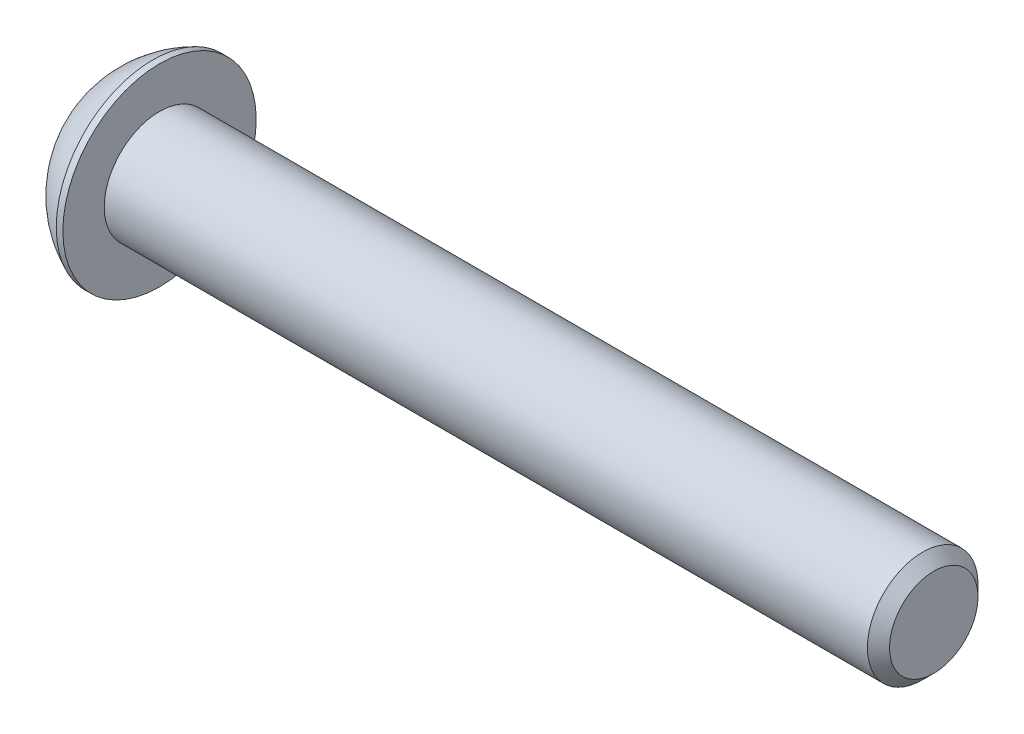
ISO-10303-21;
HEADER;
FILE_DESCRIPTION(('STEP AP214'),'2;1');
FILE_NAME('part.step','',(''),(''),'','','');
FILE_SCHEMA(('AUTOMOTIVE_DESIGN { 1 0 10303 214 1 1 1 1 }'));
ENDSEC;
DATA;
#1=APPLICATION_CONTEXT('core data for automotive mechanical design processes');
#2=APPLICATION_PROTOCOL_DEFINITION('international standard','automotive_design',2000,#1);
#3=PRODUCT_CONTEXT('',#1,'mechanical');
#4=PRODUCT('Part','Part','',(#3));
#5=PRODUCT_RELATED_PRODUCT_CATEGORY('part','',(#4));
#6=PRODUCT_DEFINITION_FORMATION('','',#4);
#7=PRODUCT_DEFINITION_CONTEXT('part definition',#1,'design');
#8=PRODUCT_DEFINITION('design','',#6,#7);
#9=PRODUCT_DEFINITION_SHAPE('','',#8);
#10=(LENGTH_UNIT() NAMED_UNIT(*) SI_UNIT(.MILLI.,.METRE.));
#11=(NAMED_UNIT(*) PLANE_ANGLE_UNIT() SI_UNIT($,.RADIAN.));
#12=(NAMED_UNIT(*) SI_UNIT($,.STERADIAN.) SOLID_ANGLE_UNIT());
#13=UNCERTAINTY_MEASURE_WITH_UNIT(LENGTH_MEASURE(1.E-05),#10,'distance_accuracy_value','');
#14=(GEOMETRIC_REPRESENTATION_CONTEXT(3) GLOBAL_UNCERTAINTY_ASSIGNED_CONTEXT((#13)) GLOBAL_UNIT_ASSIGNED_CONTEXT((#10,
#11,#12)) REPRESENTATION_CONTEXT('',''));
#15=CARTESIAN_POINT('',(0.,0.,0.));
#16=DIRECTION('',(0.,0.,1.));
#17=DIRECTION('',(1.,0.,0.));
#18=AXIS2_PLACEMENT_3D('',#15,#16,#17);
#19=CARTESIAN_POINT('',(1.32080000000034,0.,0.));
#20=DIRECTION('',(-1.,0.,0.));
#21=DIRECTION('',(0.,0.,1.));
#22=AXIS2_PLACEMENT_3D('',#19,#20,#21);
#23=CONICAL_SURFACE('',#22,1.1937999999998,1.04719755119608);
#24=CARTESIAN_POINT('',(2.01004075135902,0.,-4.44089209850063E-13));
#25=VERTEX_POINT('',#24);
#26=VERTEX_LOOP('',#25);
#27=FACE_BOUND('',#26,.T.);
#28=CARTESIAN_POINT('',(1.32080000000009,0.,0.));
#29=DIRECTION('',(-1.,0.,0.));
#30=DIRECTION('',(0.,0.,1.));
#31=AXIS2_PLACEMENT_3D('',#28,#29,#30);
#32=CIRCLE('',#31,1.19380000000024);
#33=CARTESIAN_POINT('',(1.32080000000009,0.,1.19380000000024));
#34=VERTEX_POINT('',#33);
#35=EDGE_CURVE('E20',#34,#34,#32,.T.);
#36=ORIENTED_EDGE('',*,*,#35,.T.);
#37=EDGE_LOOP('',(#36));
#38=FACE_BOUND('',#37,.T.);
#39=ADVANCED_FACE('F17',(#27,#38),#23,.F.);
#40=CARTESIAN_POINT('',(1.3208,-2.29135888084633,0.));
#41=DIRECTION('',(1.,0.,0.));
#42=DIRECTION('',(0.,0.,-1.));
#43=AXIS2_PLACEMENT_3D('',#40,#41,#42);
#44=PLANE('',#43);
#45=DIRECTION('',(0.,1.,0.));
#46=VECTOR('',#45,1.);
#47=CARTESIAN_POINT('',(1.3208,-1.14567944042316,1.984375));
#48=LINE('',#47,#46);
#49=CARTESIAN_POINT('',(1.3208,1.14567944042316,1.984375));
#50=VERTEX_POINT('',#49);
#51=CARTESIAN_POINT('',(1.3208,-1.14567944042316,1.984375));
#52=VERTEX_POINT('',#51);
#53=EDGE_CURVE('E69',#50,#52,#48,.F.);
#54=ORIENTED_EDGE('',*,*,#53,.F.);
#55=DIRECTION('',(0.,0.5,-0.866025403784439));
#56=VECTOR('',#55,1.);
#57=CARTESIAN_POINT('',(1.3208,1.14567944042316,1.984375));
#58=LINE('',#57,#56);
#59=CARTESIAN_POINT('',(1.3208,2.29135888084633,0.));
#60=VERTEX_POINT('',#59);
#61=EDGE_CURVE('E292',#60,#50,#58,.F.);
#62=ORIENTED_EDGE('',*,*,#61,.F.);
#63=DIRECTION('',(0.,-0.5,-0.866025403784439));
#64=VECTOR('',#63,1.);
#65=CARTESIAN_POINT('',(1.3208,2.29135888084633,0.));
#66=LINE('',#65,#64);
#67=CARTESIAN_POINT('',(1.3208,1.14567944042316,-1.984375));
#68=VERTEX_POINT('',#67);
#69=EDGE_CURVE('E296',#68,#60,#66,.F.);
#70=ORIENTED_EDGE('',*,*,#69,.F.);
#71=DIRECTION('',(0.,1.,0.));
#72=VECTOR('',#71,1.);
#73=CARTESIAN_POINT('',(1.3208,1.14567944042316,-1.984375));
#74=LINE('',#73,#72);
#75=CARTESIAN_POINT('',(1.3208,-1.14567944042316,-1.984375));
#76=VERTEX_POINT('',#75);
#77=EDGE_CURVE('E301',#76,#68,#74,.T.);
#78=ORIENTED_EDGE('',*,*,#77,.F.);
#79=DIRECTION('',(0.,-0.500000000000001,0.866025403784438));
#80=VECTOR('',#79,1.);
#81=CARTESIAN_POINT('',(1.3208,-1.14567944042316,-1.984375));
#82=LINE('',#81,#80);
#83=CARTESIAN_POINT('',(1.3208,-2.29135888084633,0.));
#84=VERTEX_POINT('',#83);
#85=EDGE_CURVE('E306',#84,#76,#82,.F.);
#86=ORIENTED_EDGE('',*,*,#85,.F.);
#87=DIRECTION('',(0.,0.500000000000001,0.866025403784438));
#88=VECTOR('',#87,1.);
#89=CARTESIAN_POINT('',(1.3208,-2.29135888084633,0.));
#90=LINE('',#89,#88);
#91=EDGE_CURVE('E82',#52,#84,#90,.F.);
#92=ORIENTED_EDGE('',*,*,#91,.F.);
#93=EDGE_LOOP('',(#54,#62,#70,#78,#86,#92));
#94=FACE_BOUND('',#93,.T.);
#95=ORIENTED_EDGE('',*,*,#35,.F.);
#96=EDGE_LOOP('',(#95));
#97=FACE_BOUND('',#96,.T.);
#98=ADVANCED_FACE('F75',(#94,#97),#44,.F.);
#99=CARTESIAN_POINT('',(1.3208,-1.14567944042316,1.984375));
#100=DIRECTION('',(0.,0.,-1.));
#101=DIRECTION('',(0.,1.,0.));
#102=AXIS2_PLACEMENT_3D('',#99,#100,#101);
#103=PLANE('',#102);
#104=ORIENTED_EDGE('',*,*,#53,.T.);
#105=DIRECTION('',(1.,0.,0.));
#106=VECTOR('',#105,1.);
#107=CARTESIAN_POINT('',(1.3208,-1.14567944042316,1.984375));
#108=LINE('',#107,#106);
#109=CARTESIAN_POINT('',(0.,-1.14567944042316,1.984375));
#110=VERTEX_POINT('',#109);
#111=EDGE_CURVE('E79',#110,#52,#108,.T.);
#112=ORIENTED_EDGE('',*,*,#111,.F.);
#113=DIRECTION('',(0.,1.,0.));
#114=VECTOR('',#113,1.);
#115=CARTESIAN_POINT('',(0.,0.,1.984375));
#116=LINE('',#115,#114);
#117=CARTESIAN_POINT('',(0.,1.14567944042316,1.984375));
#118=VERTEX_POINT('',#117);
#119=EDGE_CURVE('E286',#118,#110,#116,.F.);
#120=ORIENTED_EDGE('',*,*,#119,.F.);
#121=DIRECTION('',(1.,0.,0.));
#122=VECTOR('',#121,1.);
#123=CARTESIAN_POINT('',(1.3208,1.14567944042316,1.984375));
#124=LINE('',#123,#122);
#125=EDGE_CURVE('E289',#50,#118,#124,.F.);
#126=ORIENTED_EDGE('',*,*,#125,.F.);
#127=EDGE_LOOP('',(#104,#112,#120,#126));
#128=FACE_BOUND('',#127,.T.);
#129=ADVANCED_FACE('F128',(#128),#103,.T.);
#130=CARTESIAN_POINT('',(1.3208,-2.29135888084633,0.));
#131=DIRECTION('',(0.,0.866025403784438,-0.500000000000001));
#132=DIRECTION('',(0.,0.500000000000001,0.866025403784438));
#133=AXIS2_PLACEMENT_3D('',#130,#131,#132);
#134=PLANE('',#133);
#135=ORIENTED_EDGE('',*,*,#91,.T.);
#136=DIRECTION('',(1.,0.,0.));
#137=VECTOR('',#136,1.);
#138=CARTESIAN_POINT('',(1.3208,-2.29135888084633,0.));
#139=LINE('',#138,#137);
#140=CARTESIAN_POINT('',(0.,-2.29135888084633,0.));
#141=VERTEX_POINT('',#140);
#142=EDGE_CURVE('E308',#141,#84,#139,.T.);
#143=ORIENTED_EDGE('',*,*,#142,.F.);
#144=DIRECTION('',(0.,-0.500000000000001,-0.866025403784438));
#145=VECTOR('',#144,1.);
#146=CARTESIAN_POINT('',(0.,-1.14567944042316,1.984375));
#147=LINE('',#146,#145);
#148=EDGE_CURVE('E283',#110,#141,#147,.T.);
#149=ORIENTED_EDGE('',*,*,#148,.F.);
#150=ORIENTED_EDGE('',*,*,#111,.T.);
#151=EDGE_LOOP('',(#135,#143,#149,#150));
#152=FACE_BOUND('',#151,.T.);
#153=ADVANCED_FACE('F124',(#152),#134,.T.);
#154=CARTESIAN_POINT('',(1.3208,-1.14567944042316,-1.984375));
#155=DIRECTION('',(0.,0.866025403784438,0.500000000000001));
#156=DIRECTION('',(0.,-0.500000000000001,0.866025403784438));
#157=AXIS2_PLACEMENT_3D('',#154,#155,#156);
#158=PLANE('',#157);
#159=ORIENTED_EDGE('',*,*,#85,.T.);
#160=DIRECTION('',(1.,0.,0.));
#161=VECTOR('',#160,1.);
#162=CARTESIAN_POINT('',(1.3208,-1.14567944042316,-1.984375));
#163=LINE('',#162,#161);
#164=CARTESIAN_POINT('',(0.,-1.14567944042316,-1.984375));
#165=VERTEX_POINT('',#164);
#166=EDGE_CURVE('E303',#165,#76,#163,.T.);
#167=ORIENTED_EDGE('',*,*,#166,.F.);
#168=DIRECTION('',(0.,0.500000000000001,-0.866025403784438));
#169=VECTOR('',#168,1.);
#170=CARTESIAN_POINT('',(0.,-2.29135888084633,0.));
#171=LINE('',#170,#169);
#172=EDGE_CURVE('E280',#141,#165,#171,.T.);
#173=ORIENTED_EDGE('',*,*,#172,.F.);
#174=ORIENTED_EDGE('',*,*,#142,.T.);
#175=EDGE_LOOP('',(#159,#167,#173,#174));
#176=FACE_BOUND('',#175,.T.);
#177=ADVANCED_FACE('F120',(#176),#158,.T.);
#178=CARTESIAN_POINT('',(1.3208,1.14567944042316,-1.984375));
#179=DIRECTION('',(0.,0.,1.));
#180=DIRECTION('',(1.,0.,0.));
#181=AXIS2_PLACEMENT_3D('',#178,#179,#180);
#182=PLANE('',#181);
#183=ORIENTED_EDGE('',*,*,#77,.T.);
#184=DIRECTION('',(1.,0.,0.));
#185=VECTOR('',#184,1.);
#186=CARTESIAN_POINT('',(1.3208,1.14567944042316,-1.984375));
#187=LINE('',#186,#185);
#188=CARTESIAN_POINT('',(0.,1.14567944042316,-1.984375));
#189=VERTEX_POINT('',#188);
#190=EDGE_CURVE('E298',#189,#68,#187,.T.);
#191=ORIENTED_EDGE('',*,*,#190,.F.);
#192=DIRECTION('',(0.,1.,0.));
#193=VECTOR('',#192,1.);
#194=CARTESIAN_POINT('',(0.,0.,-1.984375));
#195=LINE('',#194,#193);
#196=EDGE_CURVE('E277',#165,#189,#195,.T.);
#197=ORIENTED_EDGE('',*,*,#196,.F.);
#198=ORIENTED_EDGE('',*,*,#166,.T.);
#199=EDGE_LOOP('',(#183,#191,#197,#198));
#200=FACE_BOUND('',#199,.T.);
#201=ADVANCED_FACE('F117',(#200),#182,.T.);
#202=CARTESIAN_POINT('',(1.3208,2.29135888084633,0.));
#203=DIRECTION('',(0.,-0.866025403784439,0.5));
#204=DIRECTION('',(0.,-0.5,-0.866025403784439));
#205=AXIS2_PLACEMENT_3D('',#202,#203,#204);
#206=PLANE('',#205);
#207=ORIENTED_EDGE('',*,*,#69,.T.);
#208=DIRECTION('',(1.,0.,0.));
#209=VECTOR('',#208,1.);
#210=CARTESIAN_POINT('',(1.3208,2.29135888084633,0.));
#211=LINE('',#210,#209);
#212=CARTESIAN_POINT('',(0.,2.29135888084633,0.));
#213=VERTEX_POINT('',#212);
#214=EDGE_CURVE('E35',#213,#60,#211,.T.);
#215=ORIENTED_EDGE('',*,*,#214,.F.);
#216=DIRECTION('',(0.,0.5,0.866025403784439));
#217=VECTOR('',#216,1.);
#218=CARTESIAN_POINT('',(0.,1.14567944042316,-1.984375));
#219=LINE('',#218,#217);
#220=EDGE_CURVE('E274',#189,#213,#219,.T.);
#221=ORIENTED_EDGE('',*,*,#220,.F.);
#222=ORIENTED_EDGE('',*,*,#190,.T.);
#223=EDGE_LOOP('',(#207,#215,#221,#222));
#224=FACE_BOUND('',#223,.T.);
#225=ADVANCED_FACE('F113',(#224),#206,.T.);
#226=CARTESIAN_POINT('',(1.3208,1.14567944042316,1.984375));
#227=DIRECTION('',(0.,-0.866025403784439,-0.5));
#228=DIRECTION('',(0.,0.5,-0.866025403784439));
#229=AXIS2_PLACEMENT_3D('',#226,#227,#228);
#230=PLANE('',#229);
#231=ORIENTED_EDGE('',*,*,#61,.T.);
#232=ORIENTED_EDGE('',*,*,#125,.T.);
#233=DIRECTION('',(0.,-0.5,0.866025403784438));
#234=VECTOR('',#233,1.);
#235=CARTESIAN_POINT('',(0.,2.29135888084633,0.));
#236=LINE('',#235,#234);
#237=EDGE_CURVE('E100',#213,#118,#236,.T.);
#238=ORIENTED_EDGE('',*,*,#237,.F.);
#239=ORIENTED_EDGE('',*,*,#214,.T.);
#240=EDGE_LOOP('',(#231,#232,#238,#239));
#241=FACE_BOUND('',#240,.T.);
#242=ADVANCED_FACE('F109',(#241),#230,.T.);
#243=CARTESIAN_POINT('',(0.,0.,0.));
#244=DIRECTION('',(-1.,0.,0.));
#245=DIRECTION('',(0.,0.,1.));
#246=AXIS2_PLACEMENT_3D('',#243,#244,#245);
#247=PLANE('',#246);
#248=ORIENTED_EDGE('',*,*,#220,.T.);
#249=ORIENTED_EDGE('',*,*,#237,.T.);
#250=ORIENTED_EDGE('',*,*,#119,.T.);
#251=ORIENTED_EDGE('',*,*,#148,.T.);
#252=ORIENTED_EDGE('',*,*,#172,.T.);
#253=ORIENTED_EDGE('',*,*,#196,.T.);
#254=EDGE_LOOP('',(#248,#249,#250,#251,#252,#253));
#255=FACE_BOUND('',#254,.T.);
#256=CARTESIAN_POINT('',(0.,2.77495,0.));
#257=CARTESIAN_POINT('',(0.,2.77494953309947,0.0779118937523459));
#258=CARTESIAN_POINT('',(0.,2.77166578388025,0.15583810591977));
#259=CARTESIAN_POINT('',(0.,2.75855213600204,0.311152012455904));
#260=CARTESIAN_POINT('',(0.,2.74872030471467,0.388539541019556));
#261=CARTESIAN_POINT('',(0.,2.72255472645676,0.542341518735717));
#262=CARTESIAN_POINT('',(-2.70414110576258E-13,2.70621065843663,0.618754223567578));
#263=CARTESIAN_POINT('',(2.71501725221868E-13,2.66713326915777,0.769973634286023));
#264=CARTESIAN_POINT('',(1.01274952524446E-12,2.64439476297869,0.844778983646282));
#265=CARTESIAN_POINT('',(1.81909959813207E-12,2.56690195943351,1.06566239301792));
#266=CARTESIAN_POINT('',(4.77081687541822E-13,2.50280672569928,1.20857954243987));
#267=CARTESIAN_POINT('',(-4.76232447128612E-13,2.35149826934097,1.48160874561538));
#268=CARTESIAN_POINT('',(0.,2.26428416790397,1.61172031233499));
#269=CARTESIAN_POINT('',(0.,2.1181093928834,1.79445660654268));
#270=CARTESIAN_POINT('',(0.,2.06678693791626,1.85333128513996));
#271=CARTESIAN_POINT('',(0.,1.95940522984449,1.96650727912792));
#272=CARTESIAN_POINT('',(0.,1.90335059143535,2.02081294920044));
#273=CARTESIAN_POINT('',(0.,1.78683891013963,2.12453280878582));
#274=CARTESIAN_POINT('',(0.,1.72637988450322,2.1739447713554));
#275=CARTESIAN_POINT('',(0.,1.60151968865711,2.26750481692908));
#276=CARTESIAN_POINT('',(0.,1.53711760864537,2.31165167810847));
#277=CARTESIAN_POINT('',(0.,1.33869902291632,2.43567242603944));
#278=CARTESIAN_POINT('',(0.,1.19934704110695,2.507235886628));
#279=CARTESIAN_POINT('',(0.,0.910681609121881,2.62590828672821));
#280=CARTESIAN_POINT('',(0.,0.761368265357398,2.67301748742278));
#281=CARTESIAN_POINT('',(0.,0.456932649466623,2.74151230664007));
#282=CARTESIAN_POINT('',(0.,0.301810346322584,2.76289778778721));
#283=CARTESIAN_POINT('',(0.,-0.00982263870895171,2.77931595661156));
#284=CARTESIAN_POINT('',(0.,-0.166333320596448,2.77434864428877));
#285=CARTESIAN_POINT('',(0.,-0.476280836814452,2.73822217653073));
#286=CARTESIAN_POINT('',(0.,-0.629717687555985,2.70706316096981));
#287=CARTESIAN_POINT('',(0.,-0.929254830044274,2.61937980771149));
#288=CARTESIAN_POINT('',(0.,-1.0753550434132,2.56285519909568));
#289=CARTESIAN_POINT('',(0.,-1.28570692598579,2.46037024128109));
#290=CARTESIAN_POINT('',(0.,-1.35439130022287,2.42323494812896));
#291=CARTESIAN_POINT('',(0.,-1.488391287199,2.34331277270256));
#292=CARTESIAN_POINT('',(0.,-1.55370767631787,2.30052720108831));
#293=CARTESIAN_POINT('',(0.,-1.68047292776594,2.20962421887055));
#294=CARTESIAN_POINT('',(0.,-1.7419235278682,2.16150923122348));
#295=CARTESIAN_POINT('',(0.,-1.86060297067992,2.06024311301283));
#296=CARTESIAN_POINT('',(0.,-1.91782768181715,2.0070871669763));
#297=CARTESIAN_POINT('',(0.,-2.08239462196651,1.8407220856554));
#298=CARTESIAN_POINT('',(0.,-2.18279764272601,1.72049499758422));
#299=CARTESIAN_POINT('',(0.,-2.36195754944063,1.46487629213018));
#300=CARTESIAN_POINT('',(0.,-2.44071525816758,1.32948525142807));
#301=CARTESIAN_POINT('',(0.,-2.54098882695274,1.11796734074395));
#302=CARTESIAN_POINT('',(0.,-2.57146177392727,1.04596540008347));
#303=CARTESIAN_POINT('',(0.,-2.62621251108999,0.899689259475764));
#304=CARTESIAN_POINT('',(0.,-2.65049531495563,0.825416953360952));
#305=CARTESIAN_POINT('',(0.,-2.69267708798766,0.675215808695207));
#306=CARTESIAN_POINT('',(0.,-2.71058613777937,0.599289789313092));
#307=CARTESIAN_POINT('',(0.,-2.73994710360127,0.446213628496932));
#308=CARTESIAN_POINT('',(0.,-2.75140092413871,0.369063855024788));
#309=CARTESIAN_POINT('',(0.,-2.76470470685522,0.24316208817343));
#310=CARTESIAN_POINT('',(0.,-2.76854547596618,0.194611672428577));
#311=CARTESIAN_POINT('',(0.,-2.77366826843264,0.0973760351839812));
#312=CARTESIAN_POINT('',(0.,-2.77495029178814,0.0486908136842395));
#313=CARTESIAN_POINT('',(0.,-2.77494953309947,-0.0779118937523475));
#314=CARTESIAN_POINT('',(0.,-2.77166578388025,-0.155838105919772));
#315=CARTESIAN_POINT('',(0.,-2.75855213600204,-0.311152012455906));
#316=CARTESIAN_POINT('',(0.,-2.74872030471467,-0.388539541019558));
#317=CARTESIAN_POINT('',(0.,-2.72255472645677,-0.542341518735719));
#318=CARTESIAN_POINT('',(-2.70149297926331E-13,-2.70621065843663,-0.61875422356758));
#319=CARTESIAN_POINT('',(2.712366972268E-13,-2.66713326915777,-0.769973634286024));
#320=CARTESIAN_POINT('',(1.0114146773846E-12,-2.64439476297869,-0.844778983646283));
#321=CARTESIAN_POINT('',(1.81656702958366E-12,-2.5669019594335,-1.06566239301792));
#322=CARTESIAN_POINT('',(4.7641829195856E-13,-2.50280672569928,-1.20857954243988));
#323=CARTESIAN_POINT('',(-4.75569026324205E-13,-2.35149826934097,-1.48160874561538));
#324=CARTESIAN_POINT('',(0.,-2.26428416790396,-1.61172031233499));
#325=CARTESIAN_POINT('',(0.,-2.1181093928834,-1.79445660654268));
#326=CARTESIAN_POINT('',(0.,-2.06678693791626,-1.85333128513997));
#327=CARTESIAN_POINT('',(0.,-1.95940522984449,-1.96650727912792));
#328=CARTESIAN_POINT('',(0.,-1.90335059143535,-2.02081294920044));
#329=CARTESIAN_POINT('',(0.,-1.78683891013963,-2.12453280878582));
#330=CARTESIAN_POINT('',(0.,-1.72637988450322,-2.1739447713554));
#331=CARTESIAN_POINT('',(0.,-1.60151968865711,-2.26750481692908));
#332=CARTESIAN_POINT('',(0.,-1.53711760864537,-2.31165167810847));
#333=CARTESIAN_POINT('',(0.,-1.33869902291632,-2.43567242603944));
#334=CARTESIAN_POINT('',(0.,-1.19934704110695,-2.507235886628));
#335=CARTESIAN_POINT('',(0.,-0.91068160912188,-2.62590828672821));
#336=CARTESIAN_POINT('',(0.,-0.761368265357396,-2.67301748742278));
#337=CARTESIAN_POINT('',(0.,-0.456932649466621,-2.74151230664007));
#338=CARTESIAN_POINT('',(0.,-0.301810346322582,-2.76289778778721));
#339=CARTESIAN_POINT('',(0.,0.00982263870895353,-2.77931595661156));
#340=CARTESIAN_POINT('',(0.,0.16633332059645,-2.77434864428876));
#341=CARTESIAN_POINT('',(0.,0.476280836814454,-2.73822217653073));
#342=CARTESIAN_POINT('',(0.,0.629717687555987,-2.70706316096981));
#343=CARTESIAN_POINT('',(0.,0.929254830044276,-2.6193798077115));
#344=CARTESIAN_POINT('',(0.,1.0753550434132,-2.56285519909568));
#345=CARTESIAN_POINT('',(0.,1.28570692598579,-2.46037024128109));
#346=CARTESIAN_POINT('',(0.,1.35439130022287,-2.42323494812896));
#347=CARTESIAN_POINT('',(0.,1.488391287199,-2.34331277270256));
#348=CARTESIAN_POINT('',(0.,1.55370767631787,-2.30052720108831));
#349=CARTESIAN_POINT('',(0.,1.68047292776594,-2.20962421887055));
#350=CARTESIAN_POINT('',(0.,1.7419235278682,-2.16150923122348));
#351=CARTESIAN_POINT('',(0.,1.86060297067992,-2.06024311301282));
#352=CARTESIAN_POINT('',(0.,1.91782768181716,-2.0070871669763));
#353=CARTESIAN_POINT('',(0.,2.08239462196651,-1.8407220856554));
#354=CARTESIAN_POINT('',(0.,2.18279764272601,-1.72049499758422));
#355=CARTESIAN_POINT('',(0.,2.36195754944063,-1.46487629213018));
#356=CARTESIAN_POINT('',(0.,2.44071525816757,-1.32948525142807));
#357=CARTESIAN_POINT('',(0.,2.54098882695273,-1.11796734074395));
#358=CARTESIAN_POINT('',(0.,2.57146177392727,-1.04596540008347));
#359=CARTESIAN_POINT('',(0.,2.62621251108999,-0.899689259475765));
#360=CARTESIAN_POINT('',(0.,2.65049531495563,-0.825416953360953));
#361=CARTESIAN_POINT('',(0.,2.69267708798766,-0.675215808695207));
#362=CARTESIAN_POINT('',(0.,2.71058613777936,-0.599289789313092));
#363=CARTESIAN_POINT('',(0.,2.73994710360127,-0.446213628496932));
#364=CARTESIAN_POINT('',(0.,2.75140092413871,-0.369063855024789));
#365=CARTESIAN_POINT('',(0.,2.76470470685522,-0.243162088173432));
#366=CARTESIAN_POINT('',(0.,2.76854547596618,-0.194611672428578));
#367=CARTESIAN_POINT('',(0.,2.77366826843264,-0.0973760351839823));
#368=CARTESIAN_POINT('',(0.,2.77495029178814,-0.0486908136842408));
#369=CARTESIAN_POINT('',(0.,2.77495,0.));
#370=B_SPLINE_CURVE_WITH_KNOTS('',3,(#256,#257,#258,#259,#260,#261,#262,#263,#264,#265,#266,
#267,#268,#269,#270,#271,#272,#273,#274,#275,#276,#277,#278,#279,#280,#281,#282,#283,#284,#285,
#286,#287,#288,#289,#290,#291,#292,#293,#294,#295,#296,#297,#298,#299,#300,#301,#302,#303,#304,
#305,#306,#307,#308,#309,#310,#311,#312,#313,#314,#315,#316,#317,#318,#319,#320,#321,#322,#323,
#324,#325,#326,#327,#328,#329,#330,#331,#332,#333,#334,#335,#336,#337,#338,#339,#340,#341,#342,
#343,#344,#345,#346,#347,#348,#349,#350,#351,#352,#353,#354,#355,#356,#357,#358,#359,#360,#361,
#362,#363,#364,#365,#366,#367,#368,#369),.UNSPECIFIED.,.T.,.F.,(4,2,2,2,2,2,2,2,2,2,2,2,2,2,2,2,
2,2,2,2,2,2,2,2,2,2,2,2,2,2,2,2,2,2,2,2,2,2,2,2,2,2,2,2,2,2,2,2,2,2,2,2,2,2,2,2,4),(0.,
0.233690856748162,0.467450716578751,0.701582538521471,0.935904756015414,1.40343220467667,
1.87097742791502,2.10505636898837,2.33890962270652,2.57286880998746,2.80688218486306,
3.27442101763127,3.74195485676357,4.20949119271389,4.67702752866417,5.14456136779641,
5.61210020056468,5.84611357544033,6.08007276272136,6.31392601643949,6.54800495751273,
7.01555018075072,7.48307762941212,7.71739984690652,7.95153166884955,8.18529152868023,
8.41898238542855,8.56502681353347,8.71107124163843,8.94476209838659,9.17852195821718,
9.4126537801599,9.64697599765384,10.1145034463151,10.5820486695534,10.8161276106268,
11.0499808643449,11.2839400516259,11.5179534265015,11.9854922592697,12.453026098402,
12.9205624343523,13.3880987703026,13.8556326094348,14.3231714422031,14.5571848170788,
14.7911440043598,15.0249972580779,15.2590761991512,15.7266214223891,16.1941488710506,
16.4284710885449,16.662602910488,16.8963627703186,17.130053627067,17.2760980551719,
17.4221424832769),.UNSPECIFIED.);
#371=CARTESIAN_POINT('',(0.,2.77495,0.));
#372=VERTEX_POINT('',#371);
#373=EDGE_CURVE('E94',#372,#372,#370,.T.);
#374=ORIENTED_EDGE('',*,*,#373,.F.);
#375=EDGE_LOOP('',(#374));
#376=FACE_BOUND('',#375,.T.);
#377=ADVANCED_FACE('F105',(#255,#376),#247,.T.);
#378=CARTESIAN_POINT('',(5.37260881410256,0.,0.));
#379=DIRECTION('',(0.,1.,0.));
#380=DIRECTION('',(1.,0.,0.));
#381=AXIS2_PLACEMENT_3D('',#378,#379,#380);
#382=SPHERICAL_SURFACE('',#381,6.04692260342999);
#383=CARTESIAN_POINT('',(2.9718,0.,0.));
#384=DIRECTION('',(-1.,0.,0.));
#385=DIRECTION('',(0.,0.,1.));
#386=AXIS2_PLACEMENT_3D('',#383,#384,#385);
#387=CIRCLE('',#386,5.5499);
#388=CARTESIAN_POINT('',(2.9718,0.,5.5499));
#389=VERTEX_POINT('',#388);
#390=EDGE_CURVE('E92',#389,#389,#387,.F.);
#391=ORIENTED_EDGE('',*,*,#390,.F.);
#392=EDGE_LOOP('',(#391));
#393=FACE_BOUND('',#392,.T.);
#394=ORIENTED_EDGE('',*,*,#373,.T.);
#395=EDGE_LOOP('',(#394));
#396=FACE_BOUND('',#395,.T.);
#397=ADVANCED_FACE('F101',(#393,#396),#382,.T.);
#398=CARTESIAN_POINT('',(47.8028,0.,0.));
#399=DIRECTION('',(-1.,0.,0.));
#400=DIRECTION('',(0.,0.,1.));
#401=AXIS2_PLACEMENT_3D('',#398,#399,#400);
#402=PLANE('',#401);
#403=CARTESIAN_POINT('',(47.8027999999995,0.,0.));
#404=DIRECTION('',(-1.,0.,0.));
#405=DIRECTION('',(0.,0.,1.));
#406=AXIS2_PLACEMENT_3D('',#403,#404,#405);
#407=CIRCLE('',#406,2.54000000006727);
#408=CARTESIAN_POINT('',(47.8027999999995,0.,2.54000000006727));
#409=VERTEX_POINT('',#408);
#410=EDGE_CURVE('E89',#409,#409,#407,.T.);
#411=ORIENTED_EDGE('',*,*,#410,.F.);
#412=EDGE_LOOP('',(#411));
#413=FACE_BOUND('',#412,.T.);
#414=ADVANCED_FACE('F154',(#413),#402,.F.);
#415=CARTESIAN_POINT('',(0.,0.,0.));
#416=DIRECTION('',(-1.,0.,0.));
#417=DIRECTION('',(0.,0.,1.));
#418=AXIS2_PLACEMENT_3D('',#415,#416,#417);
#419=CYLINDRICAL_SURFACE('',#418,5.5499);
#420=ORIENTED_EDGE('',*,*,#390,.T.);
#421=EDGE_LOOP('',(#420));
#422=FACE_BOUND('',#421,.T.);
#423=CARTESIAN_POINT('',(3.3528,0.,0.));
#424=DIRECTION('',(-1.,0.,0.));
#425=DIRECTION('',(0.,0.,1.));
#426=AXIS2_PLACEMENT_3D('',#423,#424,#425);
#427=CIRCLE('',#426,5.5499);
#428=CARTESIAN_POINT('',(3.3528,0.,5.5499));
#429=VERTEX_POINT('',#428);
#430=EDGE_CURVE('E86',#429,#429,#427,.T.);
#431=ORIENTED_EDGE('',*,*,#430,.T.);
#432=EDGE_LOOP('',(#431));
#433=FACE_BOUND('',#432,.T.);
#434=ADVANCED_FACE('F151',(#422,#433),#419,.T.);
#435=CARTESIAN_POINT('',(47.1678000000679,0.,0.));
#436=DIRECTION('',(-1.,0.,0.));
#437=DIRECTION('',(0.,0.,1.));
#438=AXIS2_PLACEMENT_3D('',#435,#436,#437);
#439=CONICAL_SURFACE('',#438,3.17499999999882,0.785398163397448);
#440=CARTESIAN_POINT('',(47.1678,0.,0.));
#441=DIRECTION('',(-1.,0.,0.));
#442=DIRECTION('',(0.,0.,1.));
#443=AXIS2_PLACEMENT_3D('',#440,#441,#442);
#444=CIRCLE('',#443,3.175);
#445=CARTESIAN_POINT('',(47.1678,0.,3.175));
#446=VERTEX_POINT('',#445);
#447=EDGE_CURVE('E26',#446,#446,#444,.T.);
#448=ORIENTED_EDGE('',*,*,#447,.F.);
#449=EDGE_LOOP('',(#448));
#450=FACE_BOUND('',#449,.T.);
#451=ORIENTED_EDGE('',*,*,#410,.T.);
#452=EDGE_LOOP('',(#451));
#453=FACE_BOUND('',#452,.T.);
#454=ADVANCED_FACE('F144',(#450,#453),#439,.T.);
#455=CARTESIAN_POINT('',(3.3528,3.175,0.));
#456=DIRECTION('',(-1.,0.,0.));
#457=DIRECTION('',(0.,0.,1.));
#458=AXIS2_PLACEMENT_3D('',#455,#456,#457);
#459=PLANE('',#458);
#460=CARTESIAN_POINT('',(3.3528,0.,0.));
#461=DIRECTION('',(-1.,0.,0.));
#462=DIRECTION('',(0.,0.,1.));
#463=AXIS2_PLACEMENT_3D('',#460,#461,#462);
#464=CIRCLE('',#463,3.175);
#465=CARTESIAN_POINT('',(3.3528,0.,3.175));
#466=VERTEX_POINT('',#465);
#467=EDGE_CURVE('E11',#466,#466,#464,.F.);
#468=ORIENTED_EDGE('',*,*,#467,.F.);
#469=EDGE_LOOP('',(#468));
#470=FACE_BOUND('',#469,.T.);
#471=ORIENTED_EDGE('',*,*,#430,.F.);
#472=EDGE_LOOP('',(#471));
#473=FACE_BOUND('',#472,.T.);
#474=ADVANCED_FACE('F138',(#470,#473),#459,.F.);
#475=CARTESIAN_POINT('',(0.,0.,0.));
#476=DIRECTION('',(-1.,0.,0.));
#477=DIRECTION('',(0.,0.,1.));
#478=AXIS2_PLACEMENT_3D('',#475,#476,#477);
#479=CYLINDRICAL_SURFACE('',#478,3.175);
#480=ORIENTED_EDGE('',*,*,#467,.T.);
#481=EDGE_LOOP('',(#480));
#482=FACE_BOUND('',#481,.T.);
#483=ORIENTED_EDGE('',*,*,#447,.T.);
#484=EDGE_LOOP('',(#483));
#485=FACE_BOUND('',#484,.T.);
#486=ADVANCED_FACE('F136',(#482,#485),#479,.T.);
#487=CLOSED_SHELL('',(#39,#98,#129,#153,#177,#201,#225,#242,#377,#397,#414,#434,#454,#474,#486));
#488=MANIFOLD_SOLID_BREP('B1',#487);
#489=ADVANCED_BREP_SHAPE_REPRESENTATION('',(#18,#488),#14);
#490=SHAPE_DEFINITION_REPRESENTATION(#9,#489);
ENDSEC;
END-ISO-10303-21;
